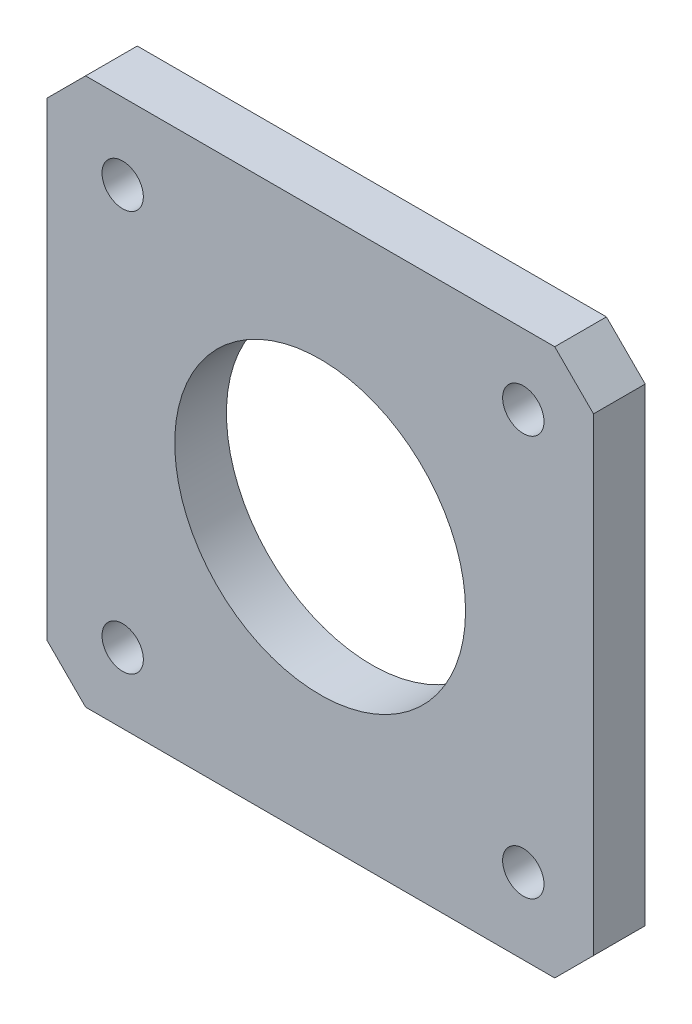
ISO-10303-21;
HEADER;
FILE_DESCRIPTION(('STEP AP214'),'2;1');
FILE_NAME('part.step','',(''),(''),'','','');
FILE_SCHEMA(('AUTOMOTIVE_DESIGN { 1 0 10303 214 1 1 1 1 }'));
ENDSEC;
DATA;
#1=APPLICATION_CONTEXT('core data for automotive mechanical design processes');
#2=APPLICATION_PROTOCOL_DEFINITION('international standard','automotive_design',2000,#1);
#3=PRODUCT_CONTEXT('',#1,'mechanical');
#4=PRODUCT('Part','Part','',(#3));
#5=PRODUCT_RELATED_PRODUCT_CATEGORY('part','',(#4));
#6=PRODUCT_DEFINITION_FORMATION('','',#4);
#7=PRODUCT_DEFINITION_CONTEXT('part definition',#1,'design');
#8=PRODUCT_DEFINITION('design','',#6,#7);
#9=PRODUCT_DEFINITION_SHAPE('','',#8);
#10=(LENGTH_UNIT() NAMED_UNIT(*) SI_UNIT(.MILLI.,.METRE.));
#11=(NAMED_UNIT(*) PLANE_ANGLE_UNIT() SI_UNIT($,.RADIAN.));
#12=(NAMED_UNIT(*) SI_UNIT($,.STERADIAN.) SOLID_ANGLE_UNIT());
#13=UNCERTAINTY_MEASURE_WITH_UNIT(LENGTH_MEASURE(1.E-05),#10,'distance_accuracy_value','');
#14=(GEOMETRIC_REPRESENTATION_CONTEXT(3) GLOBAL_UNCERTAINTY_ASSIGNED_CONTEXT((#13)) GLOBAL_UNIT_ASSIGNED_CONTEXT((#10,
#11,#12)) REPRESENTATION_CONTEXT('',''));
#15=CARTESIAN_POINT('',(0.,0.,0.));
#16=DIRECTION('',(0.,0.,1.));
#17=DIRECTION('',(1.,0.,0.));
#18=AXIS2_PLACEMENT_3D('',#15,#16,#17);
#19=CARTESIAN_POINT('',(0.,0.,4.));
#20=DIRECTION('',(0.,0.,-1.));
#21=DIRECTION('',(-1.,0.,0.));
#22=AXIS2_PLACEMENT_3D('',#19,#20,#21);
#23=PLANE('',#22);
#24=DIRECTION('',(0.,-1.,0.));
#25=VECTOR('',#24,1.);
#26=CARTESIAN_POINT('',(-21.15,-21.15,4.));
#27=LINE('',#26,#25);
#28=CARTESIAN_POINT('',(-21.15,18.15,4.));
#29=VERTEX_POINT('',#28);
#30=CARTESIAN_POINT('',(-21.15,-18.15,4.));
#31=VERTEX_POINT('',#30);
#32=EDGE_CURVE('E165',#29,#31,#27,.T.);
#33=ORIENTED_EDGE('',*,*,#32,.T.);
#34=DIRECTION('',(-0.707106781186547,0.707106781186548,0.));
#35=VECTOR('',#34,1.);
#36=CARTESIAN_POINT('',(-18.15,-21.15,4.));
#37=LINE('',#36,#35);
#38=CARTESIAN_POINT('',(-18.15,-21.15,4.));
#39=VERTEX_POINT('',#38);
#40=EDGE_CURVE('E148',#31,#39,#37,.F.);
#41=ORIENTED_EDGE('',*,*,#40,.T.);
#42=DIRECTION('',(1.,0.,0.));
#43=VECTOR('',#42,1.);
#44=CARTESIAN_POINT('',(-21.15,-21.15,4.));
#45=LINE('',#44,#43);
#46=CARTESIAN_POINT('',(18.15,-21.15,4.));
#47=VERTEX_POINT('',#46);
#48=EDGE_CURVE('E119',#39,#47,#45,.T.);
#49=ORIENTED_EDGE('',*,*,#48,.T.);
#50=DIRECTION('',(-0.707106781186548,-0.707106781186547,0.));
#51=VECTOR('',#50,1.);
#52=CARTESIAN_POINT('',(21.15,-18.15,4.));
#53=LINE('',#52,#51);
#54=CARTESIAN_POINT('',(21.15,-18.15,4.));
#55=VERTEX_POINT('',#54);
#56=EDGE_CURVE('E146',#47,#55,#53,.F.);
#57=ORIENTED_EDGE('',*,*,#56,.T.);
#58=DIRECTION('',(0.,1.,0.));
#59=VECTOR('',#58,1.);
#60=CARTESIAN_POINT('',(21.15,-21.15,4.));
#61=LINE('',#60,#59);
#62=CARTESIAN_POINT('',(21.15,18.15,4.));
#63=VERTEX_POINT('',#62);
#64=EDGE_CURVE('E126',#55,#63,#61,.T.);
#65=ORIENTED_EDGE('',*,*,#64,.T.);
#66=DIRECTION('',(0.707106781186547,-0.707106781186548,0.));
#67=VECTOR('',#66,1.);
#68=CARTESIAN_POINT('',(18.15,21.15,4.));
#69=LINE('',#68,#67);
#70=CARTESIAN_POINT('',(18.15,21.15,4.));
#71=VERTEX_POINT('',#70);
#72=EDGE_CURVE('E54',#63,#71,#69,.F.);
#73=ORIENTED_EDGE('',*,*,#72,.T.);
#74=DIRECTION('',(-1.,0.,0.));
#75=VECTOR('',#74,1.);
#76=CARTESIAN_POINT('',(-21.15,21.15,4.));
#77=LINE('',#76,#75);
#78=CARTESIAN_POINT('',(-18.15,21.15,4.));
#79=VERTEX_POINT('',#78);
#80=EDGE_CURVE('E129',#71,#79,#77,.T.);
#81=ORIENTED_EDGE('',*,*,#80,.T.);
#82=DIRECTION('',(0.707106781186548,0.707106781186547,0.));
#83=VECTOR('',#82,1.);
#84=CARTESIAN_POINT('',(-21.15,18.15,4.));
#85=LINE('',#84,#83);
#86=EDGE_CURVE('E144',#79,#29,#85,.F.);
#87=ORIENTED_EDGE('',*,*,#86,.T.);
#88=EDGE_LOOP('',(#33,#41,#49,#57,#65,#73,#81,#87));
#89=FACE_BOUND('',#88,.T.);
#90=CARTESIAN_POINT('',(0.,0.,4.));
#91=DIRECTION('',(0.,0.,1.));
#92=DIRECTION('',(1.,0.,0.));
#93=AXIS2_PLACEMENT_3D('',#90,#91,#92);
#94=CIRCLE('',#93,11.25);
#95=CARTESIAN_POINT('',(11.25,0.,4.));
#96=VERTEX_POINT('',#95);
#97=EDGE_CURVE('E161',#96,#96,#94,.T.);
#98=ORIENTED_EDGE('',*,*,#97,.F.);
#99=EDGE_LOOP('',(#98));
#100=FACE_BOUND('',#99,.T.);
#101=CARTESIAN_POINT('',(15.7176608244126,15.7176608244126,4.));
#102=DIRECTION('',(0.,0.,1.));
#103=DIRECTION('',(1.,0.,0.));
#104=AXIS2_PLACEMENT_3D('',#101,#102,#103);
#105=CIRCLE('',#104,1.6);
#106=CARTESIAN_POINT('',(17.3176608244126,15.7176608244126,4.));
#107=VERTEX_POINT('',#106);
#108=EDGE_CURVE('E172',#107,#107,#105,.T.);
#109=ORIENTED_EDGE('',*,*,#108,.F.);
#110=EDGE_LOOP('',(#109));
#111=FACE_BOUND('',#110,.T.);
#112=CARTESIAN_POINT('',(-15.2792387967702,15.2792387967702,4.));
#113=DIRECTION('',(0.,0.,1.));
#114=DIRECTION('',(1.,0.,0.));
#115=AXIS2_PLACEMENT_3D('',#112,#113,#114);
#116=CIRCLE('',#115,1.6);
#117=CARTESIAN_POINT('',(-13.6792387967702,15.2792387967702,4.));
#118=VERTEX_POINT('',#117);
#119=EDGE_CURVE('E178',#118,#118,#116,.T.);
#120=ORIENTED_EDGE('',*,*,#119,.F.);
#121=EDGE_LOOP('',(#120));
#122=FACE_BOUND('',#121,.T.);
#123=CARTESIAN_POINT('',(15.7176608244129,-15.2823391755874,4.));
#124=DIRECTION('',(0.,0.,1.));
#125=DIRECTION('',(1.,0.,0.));
#126=AXIS2_PLACEMENT_3D('',#123,#124,#125);
#127=CIRCLE('',#126,1.6);
#128=CARTESIAN_POINT('',(17.3176608244129,-15.2823391755874,4.));
#129=VERTEX_POINT('',#128);
#130=EDGE_CURVE('E184',#129,#129,#127,.T.);
#131=ORIENTED_EDGE('',*,*,#130,.F.);
#132=EDGE_LOOP('',(#131));
#133=FACE_BOUND('',#132,.T.);
#134=CARTESIAN_POINT('',(-15.2792387967698,-15.7207612032298,4.));
#135=DIRECTION('',(0.,0.,1.));
#136=DIRECTION('',(1.,0.,0.));
#137=AXIS2_PLACEMENT_3D('',#134,#135,#136);
#138=CIRCLE('',#137,1.6);
#139=CARTESIAN_POINT('',(-13.6792387967698,-15.7207612032298,4.));
#140=VERTEX_POINT('',#139);
#141=EDGE_CURVE('E190',#140,#140,#138,.T.);
#142=ORIENTED_EDGE('',*,*,#141,.F.);
#143=EDGE_LOOP('',(#142));
#144=FACE_BOUND('',#143,.T.);
#145=ADVANCED_FACE('F34',(#89,#100,#111,#122,#133,#144),#23,.F.);
#146=CARTESIAN_POINT('',(0.,0.,0.));
#147=DIRECTION('',(0.,0.,-1.));
#148=DIRECTION('',(-1.,0.,0.));
#149=AXIS2_PLACEMENT_3D('',#146,#147,#148);
#150=PLANE('',#149);
#151=CARTESIAN_POINT('',(15.7176608244129,-15.2823391755874,0.));
#152=DIRECTION('',(0.,0.,1.));
#153=DIRECTION('',(1.,0.,0.));
#154=AXIS2_PLACEMENT_3D('',#151,#152,#153);
#155=CIRCLE('',#154,1.6);
#156=CARTESIAN_POINT('',(17.3176608244129,-15.2823391755874,0.));
#157=VERTEX_POINT('',#156);
#158=EDGE_CURVE('E187',#157,#157,#155,.T.);
#159=ORIENTED_EDGE('',*,*,#158,.T.);
#160=EDGE_LOOP('',(#159));
#161=FACE_BOUND('',#160,.T.);
#162=CARTESIAN_POINT('',(15.7176608244126,15.7176608244126,0.));
#163=DIRECTION('',(0.,0.,1.));
#164=DIRECTION('',(1.,0.,0.));
#165=AXIS2_PLACEMENT_3D('',#162,#163,#164);
#166=CIRCLE('',#165,1.6);
#167=CARTESIAN_POINT('',(17.3176608244126,15.7176608244126,0.));
#168=VERTEX_POINT('',#167);
#169=EDGE_CURVE('E175',#168,#168,#166,.T.);
#170=ORIENTED_EDGE('',*,*,#169,.T.);
#171=EDGE_LOOP('',(#170));
#172=FACE_BOUND('',#171,.T.);
#173=DIRECTION('',(1.,0.,0.));
#174=VECTOR('',#173,1.);
#175=CARTESIAN_POINT('',(-21.15,-21.15,0.));
#176=LINE('',#175,#174);
#177=CARTESIAN_POINT('',(-18.15,-21.15,0.));
#178=VERTEX_POINT('',#177);
#179=CARTESIAN_POINT('',(18.15,-21.15,0.));
#180=VERTEX_POINT('',#179);
#181=EDGE_CURVE('E116',#178,#180,#176,.T.);
#182=ORIENTED_EDGE('',*,*,#181,.F.);
#183=DIRECTION('',(0.707106781186547,-0.707106781186548,0.));
#184=VECTOR('',#183,1.);
#185=CARTESIAN_POINT('',(-19.65,-19.65,0.));
#186=LINE('',#185,#184);
#187=CARTESIAN_POINT('',(-21.15,-18.15,0.));
#188=VERTEX_POINT('',#187);
#189=EDGE_CURVE('E99',#178,#188,#186,.F.);
#190=ORIENTED_EDGE('',*,*,#189,.T.);
#191=DIRECTION('',(0.,-1.,0.));
#192=VECTOR('',#191,1.);
#193=CARTESIAN_POINT('',(-21.15,-21.15,0.));
#194=LINE('',#193,#192);
#195=CARTESIAN_POINT('',(-21.15,18.15,0.));
#196=VERTEX_POINT('',#195);
#197=EDGE_CURVE('E127',#196,#188,#194,.T.);
#198=ORIENTED_EDGE('',*,*,#197,.F.);
#199=DIRECTION('',(-0.707106781186548,-0.707106781186547,0.));
#200=VECTOR('',#199,1.);
#201=CARTESIAN_POINT('',(-19.65,19.65,0.));
#202=LINE('',#201,#200);
#203=CARTESIAN_POINT('',(-18.15,21.15,0.));
#204=VERTEX_POINT('',#203);
#205=EDGE_CURVE('E137',#196,#204,#202,.F.);
#206=ORIENTED_EDGE('',*,*,#205,.T.);
#207=DIRECTION('',(-1.,0.,0.));
#208=VECTOR('',#207,1.);
#209=CARTESIAN_POINT('',(-21.15,21.15,0.));
#210=LINE('',#209,#208);
#211=CARTESIAN_POINT('',(18.15,21.15,0.));
#212=VERTEX_POINT('',#211);
#213=EDGE_CURVE('E131',#212,#204,#210,.T.);
#214=ORIENTED_EDGE('',*,*,#213,.F.);
#215=DIRECTION('',(-0.707106781186547,0.707106781186548,0.));
#216=VECTOR('',#215,1.);
#217=CARTESIAN_POINT('',(19.65,19.65,0.));
#218=LINE('',#217,#216);
#219=CARTESIAN_POINT('',(21.15,18.15,0.));
#220=VERTEX_POINT('',#219);
#221=EDGE_CURVE('E120',#212,#220,#218,.F.);
#222=ORIENTED_EDGE('',*,*,#221,.T.);
#223=DIRECTION('',(0.,1.,0.));
#224=VECTOR('',#223,1.);
#225=CARTESIAN_POINT('',(21.15,-21.15,0.));
#226=LINE('',#225,#224);
#227=CARTESIAN_POINT('',(21.15,-18.15,0.));
#228=VERTEX_POINT('',#227);
#229=EDGE_CURVE('E160',#228,#220,#226,.T.);
#230=ORIENTED_EDGE('',*,*,#229,.F.);
#231=DIRECTION('',(0.707106781186548,0.707106781186547,0.));
#232=VECTOR('',#231,1.);
#233=CARTESIAN_POINT('',(19.65,-19.65,0.));
#234=LINE('',#233,#232);
#235=EDGE_CURVE('E110',#228,#180,#234,.F.);
#236=ORIENTED_EDGE('',*,*,#235,.T.);
#237=EDGE_LOOP('',(#182,#190,#198,#206,#214,#222,#230,#236));
#238=FACE_BOUND('',#237,.T.);
#239=CARTESIAN_POINT('',(0.,0.,0.));
#240=DIRECTION('',(0.,0.,1.));
#241=DIRECTION('',(1.,0.,0.));
#242=AXIS2_PLACEMENT_3D('',#239,#240,#241);
#243=CIRCLE('',#242,11.25);
#244=CARTESIAN_POINT('',(11.25,0.,0.));
#245=VERTEX_POINT('',#244);
#246=EDGE_CURVE('E169',#245,#245,#243,.T.);
#247=ORIENTED_EDGE('',*,*,#246,.T.);
#248=EDGE_LOOP('',(#247));
#249=FACE_BOUND('',#248,.T.);
#250=CARTESIAN_POINT('',(-15.2792387967702,15.2792387967702,0.));
#251=DIRECTION('',(0.,0.,1.));
#252=DIRECTION('',(1.,0.,0.));
#253=AXIS2_PLACEMENT_3D('',#250,#251,#252);
#254=CIRCLE('',#253,1.6);
#255=CARTESIAN_POINT('',(-13.6792387967702,15.2792387967702,0.));
#256=VERTEX_POINT('',#255);
#257=EDGE_CURVE('E181',#256,#256,#254,.T.);
#258=ORIENTED_EDGE('',*,*,#257,.T.);
#259=EDGE_LOOP('',(#258));
#260=FACE_BOUND('',#259,.T.);
#261=CARTESIAN_POINT('',(-15.2792387967698,-15.7207612032298,0.));
#262=DIRECTION('',(0.,0.,1.));
#263=DIRECTION('',(1.,0.,0.));
#264=AXIS2_PLACEMENT_3D('',#261,#262,#263);
#265=CIRCLE('',#264,1.6);
#266=CARTESIAN_POINT('',(-13.6792387967698,-15.7207612032298,0.));
#267=VERTEX_POINT('',#266);
#268=EDGE_CURVE('E193',#267,#267,#265,.T.);
#269=ORIENTED_EDGE('',*,*,#268,.T.);
#270=EDGE_LOOP('',(#269));
#271=FACE_BOUND('',#270,.T.);
#272=ADVANCED_FACE('F123',(#161,#172,#238,#249,#260,#271),#150,.T.);
#273=CARTESIAN_POINT('',(21.15,-21.15,4.));
#274=DIRECTION('',(-1.,0.,0.));
#275=DIRECTION('',(0.,0.,1.));
#276=AXIS2_PLACEMENT_3D('',#273,#274,#275);
#277=PLANE('',#276);
#278=ORIENTED_EDGE('',*,*,#64,.F.);
#279=DIRECTION('',(0.,0.,-1.));
#280=VECTOR('',#279,1.);
#281=CARTESIAN_POINT('',(21.15,-18.15,4.));
#282=LINE('',#281,#280);
#283=EDGE_CURVE('E152',#55,#228,#282,.T.);
#284=ORIENTED_EDGE('',*,*,#283,.T.);
#285=ORIENTED_EDGE('',*,*,#229,.T.);
#286=DIRECTION('',(0.,0.,1.));
#287=VECTOR('',#286,1.);
#288=CARTESIAN_POINT('',(21.15,18.15,4.));
#289=LINE('',#288,#287);
#290=EDGE_CURVE('E150',#220,#63,#289,.T.);
#291=ORIENTED_EDGE('',*,*,#290,.T.);
#292=EDGE_LOOP('',(#278,#284,#285,#291));
#293=FACE_BOUND('',#292,.T.);
#294=ADVANCED_FACE('F207',(#293),#277,.F.);
#295=CARTESIAN_POINT('',(-21.15,21.15,4.));
#296=DIRECTION('',(0.,-1.,0.));
#297=DIRECTION('',(0.,0.,-1.));
#298=AXIS2_PLACEMENT_3D('',#295,#296,#297);
#299=PLANE('',#298);
#300=ORIENTED_EDGE('',*,*,#213,.T.);
#301=DIRECTION('',(0.,0.,1.));
#302=VECTOR('',#301,1.);
#303=CARTESIAN_POINT('',(-18.15,21.15,4.));
#304=LINE('',#303,#302);
#305=EDGE_CURVE('E11',#204,#79,#304,.T.);
#306=ORIENTED_EDGE('',*,*,#305,.T.);
#307=ORIENTED_EDGE('',*,*,#80,.F.);
#308=DIRECTION('',(0.,0.,-1.));
#309=VECTOR('',#308,1.);
#310=CARTESIAN_POINT('',(18.15,21.15,4.));
#311=LINE('',#310,#309);
#312=EDGE_CURVE('E42',#71,#212,#311,.T.);
#313=ORIENTED_EDGE('',*,*,#312,.T.);
#314=EDGE_LOOP('',(#300,#306,#307,#313));
#315=FACE_BOUND('',#314,.T.);
#316=ADVANCED_FACE('F157',(#315),#299,.F.);
#317=CARTESIAN_POINT('',(-21.15,-21.15,4.));
#318=DIRECTION('',(1.,0.,0.));
#319=DIRECTION('',(0.,0.,-1.));
#320=AXIS2_PLACEMENT_3D('',#317,#318,#319);
#321=PLANE('',#320);
#322=ORIENTED_EDGE('',*,*,#197,.T.);
#323=DIRECTION('',(0.,0.,1.));
#324=VECTOR('',#323,1.);
#325=CARTESIAN_POINT('',(-21.15,-18.15,4.));
#326=LINE('',#325,#324);
#327=EDGE_CURVE('E104',#188,#31,#326,.T.);
#328=ORIENTED_EDGE('',*,*,#327,.T.);
#329=ORIENTED_EDGE('',*,*,#32,.F.);
#330=DIRECTION('',(0.,0.,-1.));
#331=VECTOR('',#330,1.);
#332=CARTESIAN_POINT('',(-21.15,18.15,4.));
#333=LINE('',#332,#331);
#334=EDGE_CURVE('E109',#29,#196,#333,.T.);
#335=ORIENTED_EDGE('',*,*,#334,.T.);
#336=EDGE_LOOP('',(#322,#328,#329,#335));
#337=FACE_BOUND('',#336,.T.);
#338=ADVANCED_FACE('F217',(#337),#321,.F.);
#339=CARTESIAN_POINT('',(-21.15,-21.15,4.));
#340=DIRECTION('',(0.,1.,0.));
#341=DIRECTION('',(0.,0.,1.));
#342=AXIS2_PLACEMENT_3D('',#339,#340,#341);
#343=PLANE('',#342);
#344=ORIENTED_EDGE('',*,*,#48,.F.);
#345=DIRECTION('',(0.,0.,-1.));
#346=VECTOR('',#345,1.);
#347=CARTESIAN_POINT('',(-18.15,-21.15,4.));
#348=LINE('',#347,#346);
#349=EDGE_CURVE('E103',#39,#178,#348,.T.);
#350=ORIENTED_EDGE('',*,*,#349,.T.);
#351=ORIENTED_EDGE('',*,*,#181,.T.);
#352=DIRECTION('',(0.,0.,1.));
#353=VECTOR('',#352,1.);
#354=CARTESIAN_POINT('',(18.15,-21.15,4.));
#355=LINE('',#354,#353);
#356=EDGE_CURVE('E121',#180,#47,#355,.T.);
#357=ORIENTED_EDGE('',*,*,#356,.T.);
#358=EDGE_LOOP('',(#344,#350,#351,#357));
#359=FACE_BOUND('',#358,.T.);
#360=ADVANCED_FACE('F115',(#359),#343,.F.);
#361=CARTESIAN_POINT('',(0.,0.,4.));
#362=DIRECTION('',(0.,0.,-1.));
#363=DIRECTION('',(-1.,0.,0.));
#364=AXIS2_PLACEMENT_3D('',#361,#362,#363);
#365=CYLINDRICAL_SURFACE('',#364,11.25);
#366=ORIENTED_EDGE('',*,*,#97,.T.);
#367=EDGE_LOOP('',(#366));
#368=FACE_BOUND('',#367,.T.);
#369=ORIENTED_EDGE('',*,*,#246,.F.);
#370=EDGE_LOOP('',(#369));
#371=FACE_BOUND('',#370,.T.);
#372=ADVANCED_FACE('F212',(#368,#371),#365,.F.);
#373=CARTESIAN_POINT('',(15.7176608244126,15.7176608244126,4.));
#374=DIRECTION('',(0.,0.,-1.));
#375=DIRECTION('',(-1.,0.,0.));
#376=AXIS2_PLACEMENT_3D('',#373,#374,#375);
#377=CYLINDRICAL_SURFACE('',#376,1.6);
#378=ORIENTED_EDGE('',*,*,#108,.T.);
#379=EDGE_LOOP('',(#378));
#380=FACE_BOUND('',#379,.T.);
#381=ORIENTED_EDGE('',*,*,#169,.F.);
#382=EDGE_LOOP('',(#381));
#383=FACE_BOUND('',#382,.T.);
#384=ADVANCED_FACE('F326',(#380,#383),#377,.F.);
#385=CARTESIAN_POINT('',(-15.2792387967702,15.2792387967702,4.));
#386=DIRECTION('',(0.,0.,-1.));
#387=DIRECTION('',(-1.,0.,0.));
#388=AXIS2_PLACEMENT_3D('',#385,#386,#387);
#389=CYLINDRICAL_SURFACE('',#388,1.6);
#390=ORIENTED_EDGE('',*,*,#119,.T.);
#391=EDGE_LOOP('',(#390));
#392=FACE_BOUND('',#391,.T.);
#393=ORIENTED_EDGE('',*,*,#257,.F.);
#394=EDGE_LOOP('',(#393));
#395=FACE_BOUND('',#394,.T.);
#396=ADVANCED_FACE('F316',(#392,#395),#389,.F.);
#397=CARTESIAN_POINT('',(15.7176608244129,-15.2823391755874,4.));
#398=DIRECTION('',(0.,0.,-1.));
#399=DIRECTION('',(-1.,0.,0.));
#400=AXIS2_PLACEMENT_3D('',#397,#398,#399);
#401=CYLINDRICAL_SURFACE('',#400,1.6);
#402=ORIENTED_EDGE('',*,*,#130,.T.);
#403=EDGE_LOOP('',(#402));
#404=FACE_BOUND('',#403,.T.);
#405=ORIENTED_EDGE('',*,*,#158,.F.);
#406=EDGE_LOOP('',(#405));
#407=FACE_BOUND('',#406,.T.);
#408=ADVANCED_FACE('F307',(#404,#407),#401,.F.);
#409=CARTESIAN_POINT('',(-15.2792387967698,-15.7207612032298,4.));
#410=DIRECTION('',(0.,0.,-1.));
#411=DIRECTION('',(-1.,0.,0.));
#412=AXIS2_PLACEMENT_3D('',#409,#410,#411);
#413=CYLINDRICAL_SURFACE('',#412,1.6);
#414=ORIENTED_EDGE('',*,*,#141,.T.);
#415=EDGE_LOOP('',(#414));
#416=FACE_BOUND('',#415,.T.);
#417=ORIENTED_EDGE('',*,*,#268,.F.);
#418=EDGE_LOOP('',(#417));
#419=FACE_BOUND('',#418,.T.);
#420=ADVANCED_FACE('F199',(#416,#419),#413,.F.);
#421=CARTESIAN_POINT('',(-18.15,-21.15,4.));
#422=DIRECTION('',(0.707106781186548,0.707106781186547,0.));
#423=DIRECTION('',(0.,0.,-1.));
#424=AXIS2_PLACEMENT_3D('',#421,#422,#423);
#425=PLANE('',#424);
#426=ORIENTED_EDGE('',*,*,#40,.F.);
#427=ORIENTED_EDGE('',*,*,#327,.F.);
#428=ORIENTED_EDGE('',*,*,#189,.F.);
#429=ORIENTED_EDGE('',*,*,#349,.F.);
#430=EDGE_LOOP('',(#426,#427,#428,#429));
#431=FACE_BOUND('',#430,.T.);
#432=ADVANCED_FACE('F102',(#431),#425,.F.);
#433=CARTESIAN_POINT('',(21.15,-18.15,4.));
#434=DIRECTION('',(-0.707106781186547,0.707106781186548,0.));
#435=DIRECTION('',(0.,0.,-1.));
#436=AXIS2_PLACEMENT_3D('',#433,#434,#435);
#437=PLANE('',#436);
#438=ORIENTED_EDGE('',*,*,#56,.F.);
#439=ORIENTED_EDGE('',*,*,#356,.F.);
#440=ORIENTED_EDGE('',*,*,#235,.F.);
#441=ORIENTED_EDGE('',*,*,#283,.F.);
#442=EDGE_LOOP('',(#438,#439,#440,#441));
#443=FACE_BOUND('',#442,.T.);
#444=ADVANCED_FACE('F228',(#443),#437,.F.);
#445=CARTESIAN_POINT('',(-21.15,18.15,4.));
#446=DIRECTION('',(0.707106781186547,-0.707106781186548,0.));
#447=DIRECTION('',(0.,0.,-1.));
#448=AXIS2_PLACEMENT_3D('',#445,#446,#447);
#449=PLANE('',#448);
#450=ORIENTED_EDGE('',*,*,#86,.F.);
#451=ORIENTED_EDGE('',*,*,#305,.F.);
#452=ORIENTED_EDGE('',*,*,#205,.F.);
#453=ORIENTED_EDGE('',*,*,#334,.F.);
#454=EDGE_LOOP('',(#450,#451,#452,#453));
#455=FACE_BOUND('',#454,.T.);
#456=ADVANCED_FACE('F230',(#455),#449,.F.);
#457=CARTESIAN_POINT('',(18.15,21.15,4.));
#458=DIRECTION('',(-0.707106781186548,-0.707106781186547,0.));
#459=DIRECTION('',(0.,0.,-1.));
#460=AXIS2_PLACEMENT_3D('',#457,#458,#459);
#461=PLANE('',#460);
#462=ORIENTED_EDGE('',*,*,#72,.F.);
#463=ORIENTED_EDGE('',*,*,#290,.F.);
#464=ORIENTED_EDGE('',*,*,#221,.F.);
#465=ORIENTED_EDGE('',*,*,#312,.F.);
#466=EDGE_LOOP('',(#462,#463,#464,#465));
#467=FACE_BOUND('',#466,.T.);
#468=ADVANCED_FACE('F36',(#467),#461,.F.);
#469=CLOSED_SHELL('',(#145,#272,#294,#316,#338,#360,#372,#384,#396,#408,#420,#432,#444,#456,#468));
#470=MANIFOLD_SOLID_BREP('B2',#469);
#471=ADVANCED_BREP_SHAPE_REPRESENTATION('',(#18,#470),#14);
#472=SHAPE_DEFINITION_REPRESENTATION(#9,#471);
ENDSEC;
END-ISO-10303-21;
